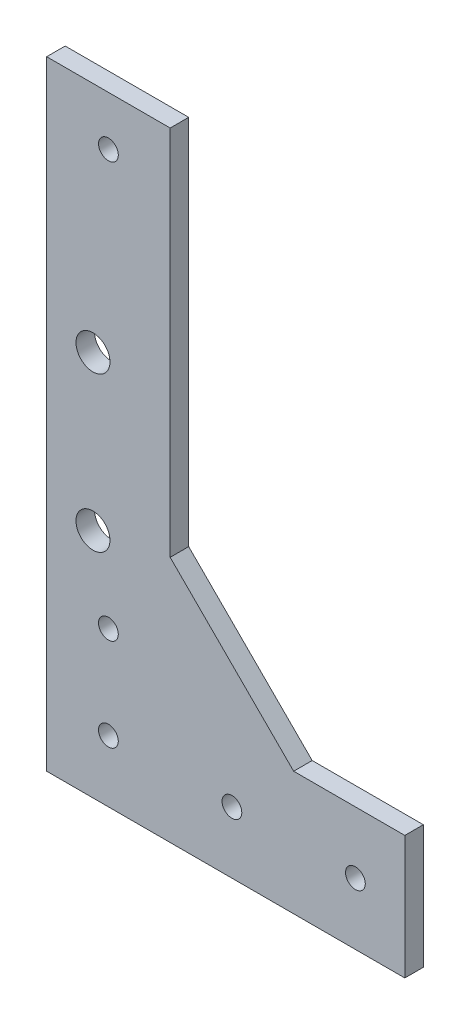
ISO-10303-21;
HEADER;
FILE_DESCRIPTION(('STEP AP214'),'2;1');
FILE_NAME('part.step','',(''),(''),'','','');
FILE_SCHEMA(('AUTOMOTIVE_DESIGN { 1 0 10303 214 1 1 1 1 }'));
ENDSEC;
DATA;
#1=APPLICATION_CONTEXT('core data for automotive mechanical design processes');
#2=APPLICATION_PROTOCOL_DEFINITION('international standard','automotive_design',2000,#1);
#3=PRODUCT_CONTEXT('',#1,'mechanical');
#4=PRODUCT('Part','Part','',(#3));
#5=PRODUCT_RELATED_PRODUCT_CATEGORY('part','',(#4));
#6=PRODUCT_DEFINITION_FORMATION('','',#4);
#7=PRODUCT_DEFINITION_CONTEXT('part definition',#1,'design');
#8=PRODUCT_DEFINITION('design','',#6,#7);
#9=PRODUCT_DEFINITION_SHAPE('','',#8);
#10=(LENGTH_UNIT() NAMED_UNIT(*) SI_UNIT(.MILLI.,.METRE.));
#11=(NAMED_UNIT(*) PLANE_ANGLE_UNIT() SI_UNIT($,.RADIAN.));
#12=(NAMED_UNIT(*) SI_UNIT($,.STERADIAN.) SOLID_ANGLE_UNIT());
#13=UNCERTAINTY_MEASURE_WITH_UNIT(LENGTH_MEASURE(1.E-05),#10,'distance_accuracy_value','');
#14=(GEOMETRIC_REPRESENTATION_CONTEXT(3) GLOBAL_UNCERTAINTY_ASSIGNED_CONTEXT((#13)) GLOBAL_UNIT_ASSIGNED_CONTEXT((#10,
#11,#12)) REPRESENTATION_CONTEXT('',''));
#15=CARTESIAN_POINT('',(0.,0.,0.));
#16=DIRECTION('',(0.,0.,1.));
#17=DIRECTION('',(1.,0.,0.));
#18=AXIS2_PLACEMENT_3D('',#15,#16,#17);
#19=CARTESIAN_POINT('',(-213.489921235063,-7.50295178642777,3.));
#20=DIRECTION('',(0.,-1.,0.));
#21=DIRECTION('',(0.,0.,-1.));
#22=AXIS2_PLACEMENT_3D('',#19,#20,#21);
#23=PLANE('',#22);
#24=DIRECTION('',(-1.,0.,0.));
#25=VECTOR('',#24,1.);
#26=CARTESIAN_POINT('',(-213.489921235063,-7.50295178642777,0.));
#27=LINE('',#26,#25);
#28=CARTESIAN_POINT('',(-195.489923187471,-7.50295178642777,0.));
#29=VERTEX_POINT('',#28);
#30=CARTESIAN_POINT('',(-213.489921235063,-7.50295178642777,0.));
#31=VERTEX_POINT('',#30);
#32=EDGE_CURVE('E125',#29,#31,#27,.T.);
#33=ORIENTED_EDGE('',*,*,#32,.T.);
#34=DIRECTION('',(0.,0.,-1.));
#35=VECTOR('',#34,1.);
#36=CARTESIAN_POINT('',(-213.489921235063,-7.50295178642777,3.));
#37=LINE('',#36,#35);
#38=CARTESIAN_POINT('',(-213.489921235063,-7.50295178642777,3.));
#39=VERTEX_POINT('',#38);
#40=EDGE_CURVE('E11',#39,#31,#37,.T.);
#41=ORIENTED_EDGE('',*,*,#40,.F.);
#42=DIRECTION('',(-1.,0.,0.));
#43=VECTOR('',#42,1.);
#44=CARTESIAN_POINT('',(-213.489921235063,-7.50295178642777,3.));
#45=LINE('',#44,#43);
#46=CARTESIAN_POINT('',(-195.489923187471,-7.50295178642777,3.));
#47=VERTEX_POINT('',#46);
#48=EDGE_CURVE('E138',#47,#39,#45,.T.);
#49=ORIENTED_EDGE('',*,*,#48,.F.);
#50=DIRECTION('',(0.,0.,-1.));
#51=VECTOR('',#50,1.);
#52=CARTESIAN_POINT('',(-195.489923187471,-7.50295178642777,3.));
#53=LINE('',#52,#51);
#54=EDGE_CURVE('E121',#47,#29,#53,.T.);
#55=ORIENTED_EDGE('',*,*,#54,.T.);
#56=EDGE_LOOP('',(#33,#41,#49,#55));
#57=FACE_BOUND('',#56,.T.);
#58=ADVANCED_FACE('F35',(#57),#23,.F.);
#59=CARTESIAN_POINT('',(-233.489921235063,12.4970482135722,3.));
#60=DIRECTION('',(-0.707106781186548,-0.707106781186547,0.));
#61=DIRECTION('',(0.707106781186547,-0.707106781186548,0.));
#62=AXIS2_PLACEMENT_3D('',#59,#60,#61);
#63=PLANE('',#62);
#64=DIRECTION('',(-0.707106781186547,0.707106781186548,0.));
#65=VECTOR('',#64,1.);
#66=CARTESIAN_POINT('',(-233.489921235063,12.4970482135722,0.));
#67=LINE('',#66,#65);
#68=CARTESIAN_POINT('',(-233.489921235063,12.4970482135722,0.));
#69=VERTEX_POINT('',#68);
#70=EDGE_CURVE('E128',#31,#69,#67,.T.);
#71=ORIENTED_EDGE('',*,*,#70,.T.);
#72=DIRECTION('',(0.,0.,-1.));
#73=VECTOR('',#72,1.);
#74=CARTESIAN_POINT('',(-233.489921235063,12.4970482135722,3.));
#75=LINE('',#74,#73);
#76=CARTESIAN_POINT('',(-233.489921235063,12.4970482135722,3.));
#77=VERTEX_POINT('',#76);
#78=EDGE_CURVE('E43',#77,#69,#75,.T.);
#79=ORIENTED_EDGE('',*,*,#78,.F.);
#80=DIRECTION('',(-0.707106781186547,0.707106781186548,0.));
#81=VECTOR('',#80,1.);
#82=CARTESIAN_POINT('',(-233.489921235063,12.4970482135722,3.));
#83=LINE('',#82,#81);
#84=EDGE_CURVE('E91',#39,#77,#83,.T.);
#85=ORIENTED_EDGE('',*,*,#84,.F.);
#86=ORIENTED_EDGE('',*,*,#40,.T.);
#87=EDGE_LOOP('',(#71,#79,#85,#86));
#88=FACE_BOUND('',#87,.T.);
#89=ADVANCED_FACE('F243',(#88),#63,.F.);
#90=CARTESIAN_POINT('',(-233.489921235063,72.709593141673,3.));
#91=DIRECTION('',(-1.,0.,0.));
#92=DIRECTION('',(0.,0.,1.));
#93=AXIS2_PLACEMENT_3D('',#90,#91,#92);
#94=PLANE('',#93);
#95=DIRECTION('',(0.,1.,0.));
#96=VECTOR('',#95,1.);
#97=CARTESIAN_POINT('',(-233.489921235063,72.709593141673,0.));
#98=LINE('',#97,#96);
#99=CARTESIAN_POINT('',(-233.489921235063,72.709593141673,0.));
#100=VERTEX_POINT('',#99);
#101=EDGE_CURVE('E131',#69,#100,#98,.T.);
#102=ORIENTED_EDGE('',*,*,#101,.T.);
#103=DIRECTION('',(0.,0.,-1.));
#104=VECTOR('',#103,1.);
#105=CARTESIAN_POINT('',(-233.489921235063,72.709593141673,3.));
#106=LINE('',#105,#104);
#107=CARTESIAN_POINT('',(-233.489921235063,72.709593141673,3.));
#108=VERTEX_POINT('',#107);
#109=EDGE_CURVE('E142',#108,#100,#106,.T.);
#110=ORIENTED_EDGE('',*,*,#109,.F.);
#111=DIRECTION('',(0.,1.,0.));
#112=VECTOR('',#111,1.);
#113=CARTESIAN_POINT('',(-233.489921235063,72.709593141673,3.));
#114=LINE('',#113,#112);
#115=EDGE_CURVE('E150',#77,#108,#114,.T.);
#116=ORIENTED_EDGE('',*,*,#115,.F.);
#117=ORIENTED_EDGE('',*,*,#78,.T.);
#118=EDGE_LOOP('',(#102,#110,#116,#117));
#119=FACE_BOUND('',#118,.T.);
#120=ADVANCED_FACE('F148',(#119),#94,.F.);
#121=CARTESIAN_POINT('',(-253.489921235063,72.709593141673,3.));
#122=DIRECTION('',(0.,-1.,0.));
#123=DIRECTION('',(0.,0.,-1.));
#124=AXIS2_PLACEMENT_3D('',#121,#122,#123);
#125=PLANE('',#124);
#126=DIRECTION('',(-1.,0.,0.));
#127=VECTOR('',#126,1.);
#128=CARTESIAN_POINT('',(-253.489921235063,72.709593141673,0.));
#129=LINE('',#128,#127);
#130=CARTESIAN_POINT('',(-253.489921235063,72.709593141673,0.));
#131=VERTEX_POINT('',#130);
#132=EDGE_CURVE('E133',#100,#131,#129,.T.);
#133=ORIENTED_EDGE('',*,*,#132,.T.);
#134=DIRECTION('',(0.,0.,-1.));
#135=VECTOR('',#134,1.);
#136=CARTESIAN_POINT('',(-253.489921235063,72.709593141673,3.));
#137=LINE('',#136,#135);
#138=CARTESIAN_POINT('',(-253.489921235063,72.709593141673,3.));
#139=VERTEX_POINT('',#138);
#140=EDGE_CURVE('E116',#139,#131,#137,.T.);
#141=ORIENTED_EDGE('',*,*,#140,.F.);
#142=DIRECTION('',(-1.,0.,0.));
#143=VECTOR('',#142,1.);
#144=CARTESIAN_POINT('',(-253.489921235063,72.709593141673,3.));
#145=LINE('',#144,#143);
#146=EDGE_CURVE('E107',#108,#139,#145,.T.);
#147=ORIENTED_EDGE('',*,*,#146,.F.);
#148=ORIENTED_EDGE('',*,*,#109,.T.);
#149=EDGE_LOOP('',(#133,#141,#147,#148));
#150=FACE_BOUND('',#149,.T.);
#151=ADVANCED_FACE('F156',(#150),#125,.F.);
#152=CARTESIAN_POINT('',(-253.489921235063,72.709593141673,3.));
#153=DIRECTION('',(1.,0.,0.));
#154=DIRECTION('',(0.,0.,-1.));
#155=AXIS2_PLACEMENT_3D('',#152,#153,#154);
#156=PLANE('',#155);
#157=DIRECTION('',(0.,-1.,0.));
#158=VECTOR('',#157,1.);
#159=CARTESIAN_POINT('',(-253.489921235063,72.709593141673,0.));
#160=LINE('',#159,#158);
#161=CARTESIAN_POINT('',(-253.489921235063,-27.5029517864278,0.));
#162=VERTEX_POINT('',#161);
#163=EDGE_CURVE('E115',#131,#162,#160,.T.);
#164=ORIENTED_EDGE('',*,*,#163,.T.);
#165=DIRECTION('',(0.,0.,-1.));
#166=VECTOR('',#165,1.);
#167=CARTESIAN_POINT('',(-253.489921235063,-27.5029517864278,3.));
#168=LINE('',#167,#166);
#169=CARTESIAN_POINT('',(-253.489921235063,-27.5029517864278,3.));
#170=VERTEX_POINT('',#169);
#171=EDGE_CURVE('E112',#170,#162,#168,.T.);
#172=ORIENTED_EDGE('',*,*,#171,.F.);
#173=DIRECTION('',(0.,-1.,0.));
#174=VECTOR('',#173,1.);
#175=CARTESIAN_POINT('',(-253.489921235063,72.709593141673,3.));
#176=LINE('',#175,#174);
#177=EDGE_CURVE('E101',#139,#170,#176,.T.);
#178=ORIENTED_EDGE('',*,*,#177,.F.);
#179=ORIENTED_EDGE('',*,*,#140,.T.);
#180=EDGE_LOOP('',(#164,#172,#178,#179));
#181=FACE_BOUND('',#180,.T.);
#182=ADVANCED_FACE('F113',(#181),#156,.F.);
#183=CARTESIAN_POINT('',(-253.489921235063,-27.5029517864278,3.));
#184=DIRECTION('',(0.,1.,0.));
#185=DIRECTION('',(0.,0.,1.));
#186=AXIS2_PLACEMENT_3D('',#183,#184,#185);
#187=PLANE('',#186);
#188=DIRECTION('',(1.,0.,0.));
#189=VECTOR('',#188,1.);
#190=CARTESIAN_POINT('',(-253.489921235063,-27.5029517864278,0.));
#191=LINE('',#190,#189);
#192=CARTESIAN_POINT('',(-195.489923187471,-27.5029517864278,0.));
#193=VERTEX_POINT('',#192);
#194=EDGE_CURVE('E77',#162,#193,#191,.T.);
#195=ORIENTED_EDGE('',*,*,#194,.T.);
#196=DIRECTION('',(0.,0.,-1.));
#197=VECTOR('',#196,1.);
#198=CARTESIAN_POINT('',(-195.489923187471,-27.5029517864278,3.));
#199=LINE('',#198,#197);
#200=CARTESIAN_POINT('',(-195.489923187471,-27.5029517864278,3.));
#201=VERTEX_POINT('',#200);
#202=EDGE_CURVE('E117',#201,#193,#199,.T.);
#203=ORIENTED_EDGE('',*,*,#202,.F.);
#204=DIRECTION('',(1.,0.,0.));
#205=VECTOR('',#204,1.);
#206=CARTESIAN_POINT('',(-253.489921235063,-27.5029517864278,3.));
#207=LINE('',#206,#205);
#208=EDGE_CURVE('E105',#170,#201,#207,.T.);
#209=ORIENTED_EDGE('',*,*,#208,.F.);
#210=ORIENTED_EDGE('',*,*,#171,.T.);
#211=EDGE_LOOP('',(#195,#203,#209,#210));
#212=FACE_BOUND('',#211,.T.);
#213=ADVANCED_FACE('F119',(#212),#187,.F.);
#214=CARTESIAN_POINT('',(-195.489923187471,-7.50295178642777,3.));
#215=DIRECTION('',(-1.,0.,0.));
#216=DIRECTION('',(0.,0.,1.));
#217=AXIS2_PLACEMENT_3D('',#214,#215,#216);
#218=PLANE('',#217);
#219=DIRECTION('',(0.,1.,0.));
#220=VECTOR('',#219,1.);
#221=CARTESIAN_POINT('',(-195.489923187471,-7.50295178642777,0.));
#222=LINE('',#221,#220);
#223=EDGE_CURVE('E83',#193,#29,#222,.T.);
#224=ORIENTED_EDGE('',*,*,#223,.T.);
#225=ORIENTED_EDGE('',*,*,#54,.F.);
#226=DIRECTION('',(0.,1.,0.));
#227=VECTOR('',#226,1.);
#228=CARTESIAN_POINT('',(-195.489923187471,-7.50295178642777,3.));
#229=LINE('',#228,#227);
#230=EDGE_CURVE('E51',#201,#47,#229,.T.);
#231=ORIENTED_EDGE('',*,*,#230,.F.);
#232=ORIENTED_EDGE('',*,*,#202,.T.);
#233=EDGE_LOOP('',(#224,#225,#231,#232));
#234=FACE_BOUND('',#233,.T.);
#235=ADVANCED_FACE('F214',(#234),#218,.F.);
#236=CARTESIAN_POINT('',(0.,0.,3.));
#237=DIRECTION('',(0.,0.,-1.));
#238=DIRECTION('',(-1.,0.,0.));
#239=AXIS2_PLACEMENT_3D('',#236,#237,#238);
#240=PLANE('',#239);
#241=CARTESIAN_POINT('',(-203.489923187471,-17.5029517864277,3.));
#242=DIRECTION('',(0.,0.,1.));
#243=DIRECTION('',(1.,0.,0.));
#244=AXIS2_PLACEMENT_3D('',#241,#242,#243);
#245=CIRCLE('',#244,1.59999999999999);
#246=CARTESIAN_POINT('',(-201.889923187471,-17.5029517864277,3.));
#247=VERTEX_POINT('',#246);
#248=EDGE_CURVE('E197',#247,#247,#245,.T.);
#249=ORIENTED_EDGE('',*,*,#248,.F.);
#250=EDGE_LOOP('',(#249));
#251=FACE_BOUND('',#250,.T.);
#252=CARTESIAN_POINT('',(-223.489923187471,-17.5029517864277,3.));
#253=DIRECTION('',(0.,0.,1.));
#254=DIRECTION('',(1.,0.,0.));
#255=AXIS2_PLACEMENT_3D('',#252,#253,#254);
#256=CIRCLE('',#255,1.59999999999999);
#257=CARTESIAN_POINT('',(-221.889923187471,-17.5029517864277,3.));
#258=VERTEX_POINT('',#257);
#259=EDGE_CURVE('E191',#258,#258,#256,.T.);
#260=ORIENTED_EDGE('',*,*,#259,.F.);
#261=EDGE_LOOP('',(#260));
#262=FACE_BOUND('',#261,.T.);
#263=CARTESIAN_POINT('',(-243.489923187471,-17.5029517864277,3.));
#264=DIRECTION('',(0.,0.,1.));
#265=DIRECTION('',(1.,0.,0.));
#266=AXIS2_PLACEMENT_3D('',#263,#264,#265);
#267=CIRCLE('',#266,1.60000000000005);
#268=CARTESIAN_POINT('',(-241.889923187471,-17.5029517864277,3.));
#269=VERTEX_POINT('',#268);
#270=EDGE_CURVE('E185',#269,#269,#267,.T.);
#271=ORIENTED_EDGE('',*,*,#270,.F.);
#272=EDGE_LOOP('',(#271));
#273=FACE_BOUND('',#272,.T.);
#274=CARTESIAN_POINT('',(-243.489923187471,-2.50295178642771,3.));
#275=DIRECTION('',(0.,0.,1.));
#276=DIRECTION('',(1.,0.,0.));
#277=AXIS2_PLACEMENT_3D('',#274,#275,#276);
#278=CIRCLE('',#277,1.59999999999996);
#279=CARTESIAN_POINT('',(-241.889923187471,-2.50295178642771,3.));
#280=VERTEX_POINT('',#279);
#281=EDGE_CURVE('E179',#280,#280,#278,.T.);
#282=ORIENTED_EDGE('',*,*,#281,.F.);
#283=EDGE_LOOP('',(#282));
#284=FACE_BOUND('',#283,.T.);
#285=CARTESIAN_POINT('',(-245.989921235074,9.99744821357242,3.));
#286=DIRECTION('',(0.,0.,1.));
#287=DIRECTION('',(1.,0.,0.));
#288=AXIS2_PLACEMENT_3D('',#285,#286,#287);
#289=CIRCLE('',#288,2.74999999999045);
#290=CARTESIAN_POINT('',(-243.239921235084,9.99744821357242,3.));
#291=VERTEX_POINT('',#290);
#292=EDGE_CURVE('E173',#291,#291,#289,.T.);
#293=ORIENTED_EDGE('',*,*,#292,.F.);
#294=EDGE_LOOP('',(#293));
#295=FACE_BOUND('',#294,.T.);
#296=CARTESIAN_POINT('',(-245.989921235074,34.9974482135724,3.));
#297=DIRECTION('',(0.,0.,1.));
#298=DIRECTION('',(1.,0.,0.));
#299=AXIS2_PLACEMENT_3D('',#296,#297,#298);
#300=CIRCLE('',#299,2.74999999999045);
#301=CARTESIAN_POINT('',(-243.239921235084,34.9974482135724,3.));
#302=VERTEX_POINT('',#301);
#303=EDGE_CURVE('E167',#302,#302,#300,.T.);
#304=ORIENTED_EDGE('',*,*,#303,.F.);
#305=EDGE_LOOP('',(#304));
#306=FACE_BOUND('',#305,.T.);
#307=CARTESIAN_POINT('',(-243.489923187471,64.709593141673,3.));
#308=DIRECTION('',(0.,0.,1.));
#309=DIRECTION('',(1.,0.,0.));
#310=AXIS2_PLACEMENT_3D('',#307,#308,#309);
#311=CIRCLE('',#310,1.59999999999999);
#312=CARTESIAN_POINT('',(-241.889923187471,64.709593141673,3.));
#313=VERTEX_POINT('',#312);
#314=EDGE_CURVE('E161',#313,#313,#311,.T.);
#315=ORIENTED_EDGE('',*,*,#314,.F.);
#316=EDGE_LOOP('',(#315));
#317=FACE_BOUND('',#316,.T.);
#318=ORIENTED_EDGE('',*,*,#48,.T.);
#319=ORIENTED_EDGE('',*,*,#84,.T.);
#320=ORIENTED_EDGE('',*,*,#115,.T.);
#321=ORIENTED_EDGE('',*,*,#146,.T.);
#322=ORIENTED_EDGE('',*,*,#177,.T.);
#323=ORIENTED_EDGE('',*,*,#208,.T.);
#324=ORIENTED_EDGE('',*,*,#230,.T.);
#325=EDGE_LOOP('',(#318,#319,#320,#321,#322,#323,#324));
#326=FACE_BOUND('',#325,.T.);
#327=ADVANCED_FACE('F103',(#251,#262,#273,#284,#295,#306,#317,#326),#240,.F.);
#328=CARTESIAN_POINT('',(0.,0.,0.));
#329=DIRECTION('',(0.,0.,-1.));
#330=DIRECTION('',(-1.,0.,0.));
#331=AXIS2_PLACEMENT_3D('',#328,#329,#330);
#332=PLANE('',#331);
#333=CARTESIAN_POINT('',(-203.489923187471,-17.5029517864277,0.));
#334=DIRECTION('',(0.,0.,1.));
#335=DIRECTION('',(1.,0.,0.));
#336=AXIS2_PLACEMENT_3D('',#333,#334,#335);
#337=CIRCLE('',#336,1.59999999999999);
#338=CARTESIAN_POINT('',(-201.889923187471,-17.5029517864277,0.));
#339=VERTEX_POINT('',#338);
#340=EDGE_CURVE('E129',#339,#339,#337,.T.);
#341=ORIENTED_EDGE('',*,*,#340,.T.);
#342=EDGE_LOOP('',(#341));
#343=FACE_BOUND('',#342,.T.);
#344=CARTESIAN_POINT('',(-223.489923187471,-17.5029517864277,0.));
#345=DIRECTION('',(0.,0.,1.));
#346=DIRECTION('',(1.,0.,0.));
#347=AXIS2_PLACEMENT_3D('',#344,#345,#346);
#348=CIRCLE('',#347,1.59999999999999);
#349=CARTESIAN_POINT('',(-221.889923187471,-17.5029517864277,0.));
#350=VERTEX_POINT('',#349);
#351=EDGE_CURVE('E194',#350,#350,#348,.T.);
#352=ORIENTED_EDGE('',*,*,#351,.T.);
#353=EDGE_LOOP('',(#352));
#354=FACE_BOUND('',#353,.T.);
#355=CARTESIAN_POINT('',(-243.489923187471,-17.5029517864277,0.));
#356=DIRECTION('',(0.,0.,1.));
#357=DIRECTION('',(1.,0.,0.));
#358=AXIS2_PLACEMENT_3D('',#355,#356,#357);
#359=CIRCLE('',#358,1.60000000000005);
#360=CARTESIAN_POINT('',(-241.889923187471,-17.5029517864277,0.));
#361=VERTEX_POINT('',#360);
#362=EDGE_CURVE('E188',#361,#361,#359,.T.);
#363=ORIENTED_EDGE('',*,*,#362,.T.);
#364=EDGE_LOOP('',(#363));
#365=FACE_BOUND('',#364,.T.);
#366=CARTESIAN_POINT('',(-243.489923187471,-2.50295178642771,0.));
#367=DIRECTION('',(0.,0.,1.));
#368=DIRECTION('',(1.,0.,0.));
#369=AXIS2_PLACEMENT_3D('',#366,#367,#368);
#370=CIRCLE('',#369,1.59999999999996);
#371=CARTESIAN_POINT('',(-241.889923187471,-2.50295178642771,0.));
#372=VERTEX_POINT('',#371);
#373=EDGE_CURVE('E182',#372,#372,#370,.T.);
#374=ORIENTED_EDGE('',*,*,#373,.T.);
#375=EDGE_LOOP('',(#374));
#376=FACE_BOUND('',#375,.T.);
#377=CARTESIAN_POINT('',(-245.989921235074,9.99744821357242,0.));
#378=DIRECTION('',(0.,0.,1.));
#379=DIRECTION('',(1.,0.,0.));
#380=AXIS2_PLACEMENT_3D('',#377,#378,#379);
#381=CIRCLE('',#380,2.74999999999045);
#382=CARTESIAN_POINT('',(-243.239921235084,9.99744821357242,0.));
#383=VERTEX_POINT('',#382);
#384=EDGE_CURVE('E176',#383,#383,#381,.T.);
#385=ORIENTED_EDGE('',*,*,#384,.T.);
#386=EDGE_LOOP('',(#385));
#387=FACE_BOUND('',#386,.T.);
#388=CARTESIAN_POINT('',(-245.989921235074,34.9974482135724,0.));
#389=DIRECTION('',(0.,0.,1.));
#390=DIRECTION('',(1.,0.,0.));
#391=AXIS2_PLACEMENT_3D('',#388,#389,#390);
#392=CIRCLE('',#391,2.74999999999045);
#393=CARTESIAN_POINT('',(-243.239921235084,34.9974482135724,0.));
#394=VERTEX_POINT('',#393);
#395=EDGE_CURVE('E170',#394,#394,#392,.T.);
#396=ORIENTED_EDGE('',*,*,#395,.T.);
#397=EDGE_LOOP('',(#396));
#398=FACE_BOUND('',#397,.T.);
#399=CARTESIAN_POINT('',(-243.489923187471,64.709593141673,0.));
#400=DIRECTION('',(0.,0.,1.));
#401=DIRECTION('',(1.,0.,0.));
#402=AXIS2_PLACEMENT_3D('',#399,#400,#401);
#403=CIRCLE('',#402,1.59999999999999);
#404=CARTESIAN_POINT('',(-241.889923187471,64.709593141673,0.));
#405=VERTEX_POINT('',#404);
#406=EDGE_CURVE('E164',#405,#405,#403,.T.);
#407=ORIENTED_EDGE('',*,*,#406,.T.);
#408=EDGE_LOOP('',(#407));
#409=FACE_BOUND('',#408,.T.);
#410=ORIENTED_EDGE('',*,*,#32,.F.);
#411=ORIENTED_EDGE('',*,*,#223,.F.);
#412=ORIENTED_EDGE('',*,*,#194,.F.);
#413=ORIENTED_EDGE('',*,*,#163,.F.);
#414=ORIENTED_EDGE('',*,*,#132,.F.);
#415=ORIENTED_EDGE('',*,*,#101,.F.);
#416=ORIENTED_EDGE('',*,*,#70,.F.);
#417=EDGE_LOOP('',(#410,#411,#412,#413,#414,#415,#416));
#418=FACE_BOUND('',#417,.T.);
#419=ADVANCED_FACE('F154',(#343,#354,#365,#376,#387,#398,#409,#418),#332,.T.);
#420=CARTESIAN_POINT('',(-243.489923187471,64.709593141673,0.));
#421=DIRECTION('',(0.,0.,1.));
#422=DIRECTION('',(1.,0.,0.));
#423=AXIS2_PLACEMENT_3D('',#420,#421,#422);
#424=CYLINDRICAL_SURFACE('',#423,1.59999999999999);
#425=ORIENTED_EDGE('',*,*,#406,.F.);
#426=EDGE_LOOP('',(#425));
#427=FACE_BOUND('',#426,.T.);
#428=ORIENTED_EDGE('',*,*,#314,.T.);
#429=EDGE_LOOP('',(#428));
#430=FACE_BOUND('',#429,.T.);
#431=ADVANCED_FACE('F228',(#427,#430),#424,.F.);
#432=CARTESIAN_POINT('',(-245.989921235074,34.9974482135724,0.));
#433=DIRECTION('',(0.,0.,1.));
#434=DIRECTION('',(1.,0.,0.));
#435=AXIS2_PLACEMENT_3D('',#432,#433,#434);
#436=CYLINDRICAL_SURFACE('',#435,2.74999999999045);
#437=ORIENTED_EDGE('',*,*,#395,.F.);
#438=EDGE_LOOP('',(#437));
#439=FACE_BOUND('',#438,.T.);
#440=ORIENTED_EDGE('',*,*,#303,.T.);
#441=EDGE_LOOP('',(#440));
#442=FACE_BOUND('',#441,.T.);
#443=ADVANCED_FACE('F230',(#439,#442),#436,.F.);
#444=CARTESIAN_POINT('',(-245.989921235074,9.99744821357242,0.));
#445=DIRECTION('',(0.,0.,1.));
#446=DIRECTION('',(1.,0.,0.));
#447=AXIS2_PLACEMENT_3D('',#444,#445,#446);
#448=CYLINDRICAL_SURFACE('',#447,2.74999999999045);
#449=ORIENTED_EDGE('',*,*,#384,.F.);
#450=EDGE_LOOP('',(#449));
#451=FACE_BOUND('',#450,.T.);
#452=ORIENTED_EDGE('',*,*,#292,.T.);
#453=EDGE_LOOP('',(#452));
#454=FACE_BOUND('',#453,.T.);
#455=ADVANCED_FACE('F237',(#451,#454),#448,.F.);
#456=CARTESIAN_POINT('',(-243.489923187471,-2.50295178642771,0.));
#457=DIRECTION('',(0.,0.,1.));
#458=DIRECTION('',(1.,0.,0.));
#459=AXIS2_PLACEMENT_3D('',#456,#457,#458);
#460=CYLINDRICAL_SURFACE('',#459,1.59999999999996);
#461=ORIENTED_EDGE('',*,*,#373,.F.);
#462=EDGE_LOOP('',(#461));
#463=FACE_BOUND('',#462,.T.);
#464=ORIENTED_EDGE('',*,*,#281,.T.);
#465=EDGE_LOOP('',(#464));
#466=FACE_BOUND('',#465,.T.);
#467=ADVANCED_FACE('F313',(#463,#466),#460,.F.);
#468=CARTESIAN_POINT('',(-243.489923187471,-17.5029517864277,0.));
#469=DIRECTION('',(0.,0.,1.));
#470=DIRECTION('',(1.,0.,0.));
#471=AXIS2_PLACEMENT_3D('',#468,#469,#470);
#472=CYLINDRICAL_SURFACE('',#471,1.60000000000005);
#473=ORIENTED_EDGE('',*,*,#362,.F.);
#474=EDGE_LOOP('',(#473));
#475=FACE_BOUND('',#474,.T.);
#476=ORIENTED_EDGE('',*,*,#270,.T.);
#477=EDGE_LOOP('',(#476));
#478=FACE_BOUND('',#477,.T.);
#479=ADVANCED_FACE('F323',(#475,#478),#472,.F.);
#480=CARTESIAN_POINT('',(-223.489923187471,-17.5029517864277,0.));
#481=DIRECTION('',(0.,0.,1.));
#482=DIRECTION('',(1.,0.,0.));
#483=AXIS2_PLACEMENT_3D('',#480,#481,#482);
#484=CYLINDRICAL_SURFACE('',#483,1.59999999999999);
#485=ORIENTED_EDGE('',*,*,#351,.F.);
#486=EDGE_LOOP('',(#485));
#487=FACE_BOUND('',#486,.T.);
#488=ORIENTED_EDGE('',*,*,#259,.T.);
#489=EDGE_LOOP('',(#488));
#490=FACE_BOUND('',#489,.T.);
#491=ADVANCED_FACE('F208',(#487,#490),#484,.F.);
#492=CARTESIAN_POINT('',(-203.489923187471,-17.5029517864277,0.));
#493=DIRECTION('',(0.,0.,1.));
#494=DIRECTION('',(1.,0.,0.));
#495=AXIS2_PLACEMENT_3D('',#492,#493,#494);
#496=CYLINDRICAL_SURFACE('',#495,1.59999999999999);
#497=ORIENTED_EDGE('',*,*,#340,.F.);
#498=EDGE_LOOP('',(#497));
#499=FACE_BOUND('',#498,.T.);
#500=ORIENTED_EDGE('',*,*,#248,.T.);
#501=EDGE_LOOP('',(#500));
#502=FACE_BOUND('',#501,.T.);
#503=ADVANCED_FACE('F205',(#499,#502),#496,.F.);
#504=CLOSED_SHELL('',(#58,#89,#120,#151,#182,#213,#235,#327,#419,#431,#443,#455,#467,#479,#491,#503));
#505=MANIFOLD_SOLID_BREP('B2',#504);
#506=ADVANCED_BREP_SHAPE_REPRESENTATION('',(#18,#505),#14);
#507=SHAPE_DEFINITION_REPRESENTATION(#9,#506);
ENDSEC;
END-ISO-10303-21;
